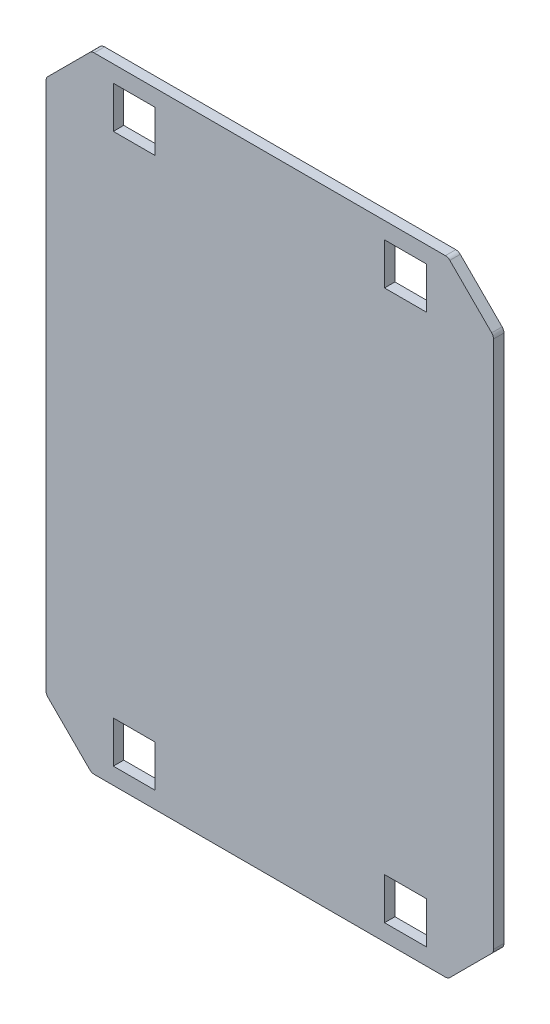
ISO-10303-21;
HEADER;
FILE_DESCRIPTION(('STEP AP214'),'2;1');
FILE_NAME('part.step','',(''),(''),'','','');
FILE_SCHEMA(('AUTOMOTIVE_DESIGN { 1 0 10303 214 1 1 1 1 }'));
ENDSEC;
DATA;
#1=APPLICATION_CONTEXT('core data for automotive mechanical design processes');
#2=APPLICATION_PROTOCOL_DEFINITION('international standard','automotive_design',2000,#1);
#3=PRODUCT_CONTEXT('',#1,'mechanical');
#4=PRODUCT('Part','Part','',(#3));
#5=PRODUCT_RELATED_PRODUCT_CATEGORY('part','',(#4));
#6=PRODUCT_DEFINITION_FORMATION('','',#4);
#7=PRODUCT_DEFINITION_CONTEXT('part definition',#1,'design');
#8=PRODUCT_DEFINITION('design','',#6,#7);
#9=PRODUCT_DEFINITION_SHAPE('','',#8);
#10=(LENGTH_UNIT() NAMED_UNIT(*) SI_UNIT(.MILLI.,.METRE.));
#11=(NAMED_UNIT(*) PLANE_ANGLE_UNIT() SI_UNIT($,.RADIAN.));
#12=(NAMED_UNIT(*) SI_UNIT($,.STERADIAN.) SOLID_ANGLE_UNIT());
#13=UNCERTAINTY_MEASURE_WITH_UNIT(LENGTH_MEASURE(1.E-05),#10,'distance_accuracy_value','');
#14=(GEOMETRIC_REPRESENTATION_CONTEXT(3) GLOBAL_UNCERTAINTY_ASSIGNED_CONTEXT((#13)) GLOBAL_UNIT_ASSIGNED_CONTEXT((#10,
#11,#12)) REPRESENTATION_CONTEXT('',''));
#15=CARTESIAN_POINT('',(0.,0.,0.));
#16=DIRECTION('',(0.,0.,1.));
#17=DIRECTION('',(1.,0.,0.));
#18=AXIS2_PLACEMENT_3D('',#15,#16,#17);
#19=CARTESIAN_POINT('',(0.,0.,5.));
#20=DIRECTION('',(0.,0.,-1.));
#21=DIRECTION('',(-1.,0.,0.));
#22=AXIS2_PLACEMENT_3D('',#19,#20,#21);
#23=PLANE('',#22);
#24=DIRECTION('',(-1.,0.,0.));
#25=VECTOR('',#24,1.);
#26=CARTESIAN_POINT('',(-75.,141.748737341529,5.));
#27=LINE('',#26,#25);
#28=CARTESIAN_POINT('',(-55.,141.748737341529,5.));
#29=VERTEX_POINT('',#28);
#30=CARTESIAN_POINT('',(-75.,141.748737341529,5.));
#31=VERTEX_POINT('',#30);
#32=EDGE_CURVE('E372',#29,#31,#27,.T.);
#33=ORIENTED_EDGE('',*,*,#32,.F.);
#34=DIRECTION('',(0.,1.,0.));
#35=VECTOR('',#34,1.);
#36=CARTESIAN_POINT('',(-55.,141.748737341529,5.));
#37=LINE('',#36,#35);
#38=CARTESIAN_POINT('',(-55.,121.748737341529,5.));
#39=VERTEX_POINT('',#38);
#40=EDGE_CURVE('E289',#39,#29,#37,.T.);
#41=ORIENTED_EDGE('',*,*,#40,.F.);
#42=DIRECTION('',(1.,0.,0.));
#43=VECTOR('',#42,1.);
#44=CARTESIAN_POINT('',(-75.,121.748737341529,5.));
#45=LINE('',#44,#43);
#46=CARTESIAN_POINT('',(-75.,121.748737341529,5.));
#47=VERTEX_POINT('',#46);
#48=EDGE_CURVE('E361',#47,#39,#45,.T.);
#49=ORIENTED_EDGE('',*,*,#48,.F.);
#50=DIRECTION('',(0.,-1.,0.));
#51=VECTOR('',#50,1.);
#52=CARTESIAN_POINT('',(-75.,141.748737341529,5.));
#53=LINE('',#52,#51);
#54=EDGE_CURVE('E375',#31,#47,#53,.T.);
#55=ORIENTED_EDGE('',*,*,#54,.F.);
#56=EDGE_LOOP('',(#33,#41,#49,#55));
#57=FACE_BOUND('',#56,.T.);
#58=DIRECTION('',(1.,0.,0.));
#59=VECTOR('',#58,1.);
#60=CARTESIAN_POINT('',(-74.9999999999999,-141.748737341529,5.));
#61=LINE('',#60,#59);
#62=CARTESIAN_POINT('',(-74.9999999999999,-141.748737341529,5.));
#63=VERTEX_POINT('',#62);
#64=CARTESIAN_POINT('',(-54.9999999999999,-141.748737341529,5.));
#65=VERTEX_POINT('',#64);
#66=EDGE_CURVE('E282',#63,#65,#61,.T.);
#67=ORIENTED_EDGE('',*,*,#66,.F.);
#68=DIRECTION('',(0.,-1.,0.));
#69=VECTOR('',#68,1.);
#70=CARTESIAN_POINT('',(-74.9999999999999,-141.748737341529,5.));
#71=LINE('',#70,#69);
#72=CARTESIAN_POINT('',(-75.,-121.748737341529,5.));
#73=VERTEX_POINT('',#72);
#74=EDGE_CURVE('E252',#73,#63,#71,.T.);
#75=ORIENTED_EDGE('',*,*,#74,.F.);
#76=DIRECTION('',(-1.,0.,0.));
#77=VECTOR('',#76,1.);
#78=CARTESIAN_POINT('',(-75.,-121.748737341529,5.));
#79=LINE('',#78,#77);
#80=CARTESIAN_POINT('',(-55.,-121.748737341529,5.));
#81=VERTEX_POINT('',#80);
#82=EDGE_CURVE('E270',#81,#73,#79,.T.);
#83=ORIENTED_EDGE('',*,*,#82,.F.);
#84=DIRECTION('',(0.,1.,0.));
#85=VECTOR('',#84,1.);
#86=CARTESIAN_POINT('',(-54.9999999999999,-141.748737341529,5.));
#87=LINE('',#86,#85);
#88=EDGE_CURVE('E273',#65,#81,#87,.T.);
#89=ORIENTED_EDGE('',*,*,#88,.F.);
#90=EDGE_LOOP('',(#67,#75,#83,#89));
#91=FACE_BOUND('',#90,.T.);
#92=DIRECTION('',(-1.,0.,0.));
#93=VECTOR('',#92,1.);
#94=CARTESIAN_POINT('',(75.,-121.748737341529,5.));
#95=LINE('',#94,#93);
#96=CARTESIAN_POINT('',(75.,-121.748737341529,5.));
#97=VERTEX_POINT('',#96);
#98=CARTESIAN_POINT('',(55.,-121.748737341529,5.));
#99=VERTEX_POINT('',#98);
#100=EDGE_CURVE('E309',#97,#99,#95,.T.);
#101=ORIENTED_EDGE('',*,*,#100,.F.);
#102=DIRECTION('',(0.,1.,0.));
#103=VECTOR('',#102,1.);
#104=CARTESIAN_POINT('',(75.,-141.748737341529,5.));
#105=LINE('',#104,#103);
#106=CARTESIAN_POINT('',(75.,-141.748737341529,5.));
#107=VERTEX_POINT('',#106);
#108=EDGE_CURVE('E307',#107,#97,#105,.T.);
#109=ORIENTED_EDGE('',*,*,#108,.F.);
#110=DIRECTION('',(1.,0.,0.));
#111=VECTOR('',#110,1.);
#112=CARTESIAN_POINT('',(75.,-141.748737341529,5.));
#113=LINE('',#112,#111);
#114=CARTESIAN_POINT('',(55.,-141.748737341529,5.));
#115=VERTEX_POINT('',#114);
#116=EDGE_CURVE('E297',#115,#107,#113,.T.);
#117=ORIENTED_EDGE('',*,*,#116,.F.);
#118=DIRECTION('',(0.,-1.,0.));
#119=VECTOR('',#118,1.);
#120=CARTESIAN_POINT('',(55.,-141.748737341529,5.));
#121=LINE('',#120,#119);
#122=EDGE_CURVE('E313',#99,#115,#121,.T.);
#123=ORIENTED_EDGE('',*,*,#122,.F.);
#124=EDGE_LOOP('',(#101,#109,#117,#123));
#125=FACE_BOUND('',#124,.T.);
#126=DIRECTION('',(-1.,0.,0.));
#127=VECTOR('',#126,1.);
#128=CARTESIAN_POINT('',(75.0000000000001,141.748737341529,5.));
#129=LINE('',#128,#127);
#130=CARTESIAN_POINT('',(75.0000000000001,141.748737341529,5.));
#131=VERTEX_POINT('',#130);
#132=CARTESIAN_POINT('',(55.0000000000001,141.748737341529,5.));
#133=VERTEX_POINT('',#132);
#134=EDGE_CURVE('E341',#131,#133,#129,.T.);
#135=ORIENTED_EDGE('',*,*,#134,.F.);
#136=DIRECTION('',(0.,1.,0.));
#137=VECTOR('',#136,1.);
#138=CARTESIAN_POINT('',(75.0000000000001,141.748737341529,5.));
#139=LINE('',#138,#137);
#140=CARTESIAN_POINT('',(75.0000000000001,121.748737341529,5.));
#141=VERTEX_POINT('',#140);
#142=EDGE_CURVE('E339',#141,#131,#139,.T.);
#143=ORIENTED_EDGE('',*,*,#142,.F.);
#144=DIRECTION('',(1.,0.,0.));
#145=VECTOR('',#144,1.);
#146=CARTESIAN_POINT('',(75.0000000000001,121.748737341529,5.));
#147=LINE('',#146,#145);
#148=CARTESIAN_POINT('',(55.0000000000001,121.748737341529,5.));
#149=VERTEX_POINT('',#148);
#150=EDGE_CURVE('E329',#149,#141,#147,.T.);
#151=ORIENTED_EDGE('',*,*,#150,.F.);
#152=DIRECTION('',(0.,-1.,0.));
#153=VECTOR('',#152,1.);
#154=CARTESIAN_POINT('',(55.0000000000001,141.748737341529,5.));
#155=LINE('',#154,#153);
#156=EDGE_CURVE('E345',#133,#149,#155,.T.);
#157=ORIENTED_EDGE('',*,*,#156,.F.);
#158=EDGE_LOOP('',(#135,#143,#151,#157));
#159=FACE_BOUND('',#158,.T.);
#160=DIRECTION('',(0.,-1.,0.));
#161=VECTOR('',#160,1.);
#162=CARTESIAN_POINT('',(-107.248737341529,127.928932188135,5.));
#163=LINE('',#162,#161);
#164=CARTESIAN_POINT('',(-107.248737341529,126.686291501015,5.));
#165=VERTEX_POINT('',#164);
#166=CARTESIAN_POINT('',(-107.248737341529,-126.686291501015,5.));
#167=VERTEX_POINT('',#166);
#168=EDGE_CURVE('E495',#165,#167,#163,.T.);
#169=ORIENTED_EDGE('',*,*,#168,.T.);
#170=CARTESIAN_POINT('',(-104.248737341529,-126.686291501015,5.));
#171=DIRECTION('',(0.,0.,-1.));
#172=DIRECTION('',(-1.,0.,0.));
#173=AXIS2_PLACEMENT_3D('',#170,#171,#172);
#174=CIRCLE('',#173,3.);
#175=CARTESIAN_POINT('',(-106.370057685089,-128.807611844575,5.));
#176=VERTEX_POINT('',#175);
#177=EDGE_CURVE('E407',#167,#176,#174,.F.);
#178=ORIENTED_EDGE('',*,*,#177,.T.);
#179=DIRECTION('',(0.707106781186548,-0.707106781186548,0.));
#180=VECTOR('',#179,1.);
#181=CARTESIAN_POINT('',(-107.248737341529,-127.928932188134,5.));
#182=LINE('',#181,#180);
#183=CARTESIAN_POINT('',(-86.3076118445748,-148.870057685089,5.));
#184=VERTEX_POINT('',#183);
#185=EDGE_CURVE('E492',#176,#184,#182,.T.);
#186=ORIENTED_EDGE('',*,*,#185,.T.);
#187=CARTESIAN_POINT('',(-84.1862915010151,-146.748737341529,5.));
#188=DIRECTION('',(0.,0.,-1.));
#189=DIRECTION('',(-1.,0.,0.));
#190=AXIS2_PLACEMENT_3D('',#187,#188,#189);
#191=CIRCLE('',#190,3.);
#192=CARTESIAN_POINT('',(-84.1862915010151,-149.748737341529,5.));
#193=VERTEX_POINT('',#192);
#194=EDGE_CURVE('E405',#184,#193,#191,.F.);
#195=ORIENTED_EDGE('',*,*,#194,.T.);
#196=DIRECTION('',(1.,0.,0.));
#197=VECTOR('',#196,1.);
#198=CARTESIAN_POINT('',(-85.4289321881344,-149.748737341529,5.));
#199=LINE('',#198,#197);
#200=CARTESIAN_POINT('',(84.1862915010154,-149.748737341529,5.));
#201=VERTEX_POINT('',#200);
#202=EDGE_CURVE('E489',#193,#201,#199,.T.);
#203=ORIENTED_EDGE('',*,*,#202,.T.);
#204=CARTESIAN_POINT('',(84.1862915010154,-146.748737341529,5.));
#205=DIRECTION('',(0.,0.,-1.));
#206=DIRECTION('',(-1.,0.,0.));
#207=AXIS2_PLACEMENT_3D('',#204,#205,#206);
#208=CIRCLE('',#207,3.);
#209=CARTESIAN_POINT('',(86.307611844575,-148.870057685089,5.));
#210=VERTEX_POINT('',#209);
#211=EDGE_CURVE('E403',#201,#210,#208,.F.);
#212=ORIENTED_EDGE('',*,*,#211,.T.);
#213=DIRECTION('',(0.707106781186547,0.707106781186548,0.));
#214=VECTOR('',#213,1.);
#215=CARTESIAN_POINT('',(107.248737341529,-127.928932188135,5.));
#216=LINE('',#215,#214);
#217=CARTESIAN_POINT('',(106.370057685089,-128.807611844575,5.));
#218=VERTEX_POINT('',#217);
#219=EDGE_CURVE('E484',#210,#218,#216,.T.);
#220=ORIENTED_EDGE('',*,*,#219,.T.);
#221=CARTESIAN_POINT('',(104.248737341529,-126.686291501015,5.));
#222=DIRECTION('',(0.,0.,-1.));
#223=DIRECTION('',(-1.,0.,0.));
#224=AXIS2_PLACEMENT_3D('',#221,#222,#223);
#225=CIRCLE('',#224,3.);
#226=CARTESIAN_POINT('',(107.248737341529,-126.686291501015,5.));
#227=VERTEX_POINT('',#226);
#228=EDGE_CURVE('E401',#218,#227,#225,.F.);
#229=ORIENTED_EDGE('',*,*,#228,.T.);
#230=DIRECTION('',(0.,1.,0.));
#231=VECTOR('',#230,1.);
#232=CARTESIAN_POINT('',(107.248737341529,127.928932188135,5.));
#233=LINE('',#232,#231);
#234=CARTESIAN_POINT('',(107.248737341529,126.686291501015,5.));
#235=VERTEX_POINT('',#234);
#236=EDGE_CURVE('E481',#227,#235,#233,.T.);
#237=ORIENTED_EDGE('',*,*,#236,.T.);
#238=CARTESIAN_POINT('',(104.248737341529,126.686291501015,5.));
#239=DIRECTION('',(0.,0.,-1.));
#240=DIRECTION('',(-1.,0.,0.));
#241=AXIS2_PLACEMENT_3D('',#238,#239,#240);
#242=CIRCLE('',#241,3.);
#243=CARTESIAN_POINT('',(106.370057685089,128.807611844575,5.));
#244=VERTEX_POINT('',#243);
#245=EDGE_CURVE('E399',#235,#244,#242,.F.);
#246=ORIENTED_EDGE('',*,*,#245,.T.);
#247=DIRECTION('',(-0.707106781186548,0.707106781186547,0.));
#248=VECTOR('',#247,1.);
#249=CARTESIAN_POINT('',(85.4289321881344,149.748737341529,5.));
#250=LINE('',#249,#248);
#251=CARTESIAN_POINT('',(86.3076118445748,148.870057685089,5.));
#252=VERTEX_POINT('',#251);
#253=EDGE_CURVE('E480',#244,#252,#250,.T.);
#254=ORIENTED_EDGE('',*,*,#253,.T.);
#255=CARTESIAN_POINT('',(84.1862915010152,146.748737341529,5.));
#256=DIRECTION('',(0.,0.,-1.));
#257=DIRECTION('',(-1.,0.,0.));
#258=AXIS2_PLACEMENT_3D('',#255,#256,#257);
#259=CIRCLE('',#258,3.);
#260=CARTESIAN_POINT('',(84.1862915010152,149.748737341529,5.));
#261=VERTEX_POINT('',#260);
#262=EDGE_CURVE('E397',#252,#261,#259,.F.);
#263=ORIENTED_EDGE('',*,*,#262,.T.);
#264=DIRECTION('',(-1.,0.,0.));
#265=VECTOR('',#264,1.);
#266=CARTESIAN_POINT('',(-85.4289321881345,149.748737341529,5.));
#267=LINE('',#266,#265);
#268=CARTESIAN_POINT('',(-84.1862915010152,149.748737341529,5.));
#269=VERTEX_POINT('',#268);
#270=EDGE_CURVE('E276',#261,#269,#267,.T.);
#271=ORIENTED_EDGE('',*,*,#270,.T.);
#272=CARTESIAN_POINT('',(-84.1862915010152,146.748737341529,5.));
#273=DIRECTION('',(0.,0.,-1.));
#274=DIRECTION('',(-1.,0.,0.));
#275=AXIS2_PLACEMENT_3D('',#272,#273,#274);
#276=CIRCLE('',#275,3.);
#277=CARTESIAN_POINT('',(-86.3076118445749,148.870057685089,5.));
#278=VERTEX_POINT('',#277);
#279=EDGE_CURVE('E393',#269,#278,#276,.F.);
#280=ORIENTED_EDGE('',*,*,#279,.T.);
#281=DIRECTION('',(-0.707106781186547,-0.707106781186548,0.));
#282=VECTOR('',#281,1.);
#283=CARTESIAN_POINT('',(-85.4289321881345,149.748737341529,5.));
#284=LINE('',#283,#282);
#285=CARTESIAN_POINT('',(-106.370057685089,128.807611844575,5.));
#286=VERTEX_POINT('',#285);
#287=EDGE_CURVE('E461',#278,#286,#284,.T.);
#288=ORIENTED_EDGE('',*,*,#287,.T.);
#289=CARTESIAN_POINT('',(-104.248737341529,126.686291501015,5.));
#290=DIRECTION('',(0.,0.,-1.));
#291=DIRECTION('',(-1.,0.,0.));
#292=AXIS2_PLACEMENT_3D('',#289,#290,#291);
#293=CIRCLE('',#292,3.);
#294=EDGE_CURVE('E395',#286,#165,#293,.F.);
#295=ORIENTED_EDGE('',*,*,#294,.T.);
#296=EDGE_LOOP('',(#169,#178,#186,#195,#203,#212,#220,#229,#237,#246,#254,#263,#271,#280,#288,#295));
#297=FACE_BOUND('',#296,.T.);
#298=ADVANCED_FACE('F34',(#57,#91,#125,#159,#297),#23,.F.);
#299=CARTESIAN_POINT('',(0.,0.,0.));
#300=DIRECTION('',(0.,0.,-1.));
#301=DIRECTION('',(-1.,0.,0.));
#302=AXIS2_PLACEMENT_3D('',#299,#300,#301);
#303=PLANE('',#302);
#304=DIRECTION('',(0.,1.,0.));
#305=VECTOR('',#304,1.);
#306=CARTESIAN_POINT('',(-55.,141.748737341529,0.));
#307=LINE('',#306,#305);
#308=CARTESIAN_POINT('',(-55.,121.748737341529,0.));
#309=VERTEX_POINT('',#308);
#310=CARTESIAN_POINT('',(-55.,141.748737341529,0.));
#311=VERTEX_POINT('',#310);
#312=EDGE_CURVE('E357',#309,#311,#307,.T.);
#313=ORIENTED_EDGE('',*,*,#312,.T.);
#314=DIRECTION('',(-1.,0.,0.));
#315=VECTOR('',#314,1.);
#316=CARTESIAN_POINT('',(-75.,141.748737341529,0.));
#317=LINE('',#316,#315);
#318=CARTESIAN_POINT('',(-75.,141.748737341529,0.));
#319=VERTEX_POINT('',#318);
#320=EDGE_CURVE('E360',#311,#319,#317,.T.);
#321=ORIENTED_EDGE('',*,*,#320,.T.);
#322=DIRECTION('',(0.,-1.,0.));
#323=VECTOR('',#322,1.);
#324=CARTESIAN_POINT('',(-75.,141.748737341529,0.));
#325=LINE('',#324,#323);
#326=CARTESIAN_POINT('',(-75.,121.748737341529,0.));
#327=VERTEX_POINT('',#326);
#328=EDGE_CURVE('E364',#319,#327,#325,.T.);
#329=ORIENTED_EDGE('',*,*,#328,.T.);
#330=DIRECTION('',(1.,0.,0.));
#331=VECTOR('',#330,1.);
#332=CARTESIAN_POINT('',(-75.,121.748737341529,0.));
#333=LINE('',#332,#331);
#334=EDGE_CURVE('E367',#327,#309,#333,.T.);
#335=ORIENTED_EDGE('',*,*,#334,.T.);
#336=EDGE_LOOP('',(#313,#321,#329,#335));
#337=FACE_BOUND('',#336,.T.);
#338=DIRECTION('',(0.,-1.,0.));
#339=VECTOR('',#338,1.);
#340=CARTESIAN_POINT('',(-74.9999999999999,-141.748737341529,0.));
#341=LINE('',#340,#339);
#342=CARTESIAN_POINT('',(-75.,-121.748737341529,0.));
#343=VERTEX_POINT('',#342);
#344=CARTESIAN_POINT('',(-74.9999999999999,-141.748737341529,0.));
#345=VERTEX_POINT('',#344);
#346=EDGE_CURVE('E249',#343,#345,#341,.T.);
#347=ORIENTED_EDGE('',*,*,#346,.T.);
#348=DIRECTION('',(1.,0.,0.));
#349=VECTOR('',#348,1.);
#350=CARTESIAN_POINT('',(-74.9999999999999,-141.748737341529,0.));
#351=LINE('',#350,#349);
#352=CARTESIAN_POINT('',(-54.9999999999999,-141.748737341529,0.));
#353=VERTEX_POINT('',#352);
#354=EDGE_CURVE('E261',#345,#353,#351,.T.);
#355=ORIENTED_EDGE('',*,*,#354,.T.);
#356=DIRECTION('',(0.,1.,0.));
#357=VECTOR('',#356,1.);
#358=CARTESIAN_POINT('',(-54.9999999999999,-141.748737341529,0.));
#359=LINE('',#358,#357);
#360=CARTESIAN_POINT('',(-55.,-121.748737341529,0.));
#361=VERTEX_POINT('',#360);
#362=EDGE_CURVE('E265',#353,#361,#359,.T.);
#363=ORIENTED_EDGE('',*,*,#362,.T.);
#364=DIRECTION('',(-1.,0.,0.));
#365=VECTOR('',#364,1.);
#366=CARTESIAN_POINT('',(-75.,-121.748737341529,0.));
#367=LINE('',#366,#365);
#368=EDGE_CURVE('E257',#361,#343,#367,.T.);
#369=ORIENTED_EDGE('',*,*,#368,.T.);
#370=EDGE_LOOP('',(#347,#355,#363,#369));
#371=FACE_BOUND('',#370,.T.);
#372=DIRECTION('',(0.,1.,0.));
#373=VECTOR('',#372,1.);
#374=CARTESIAN_POINT('',(75.,-141.748737341529,0.));
#375=LINE('',#374,#373);
#376=CARTESIAN_POINT('',(75.,-141.748737341529,0.));
#377=VERTEX_POINT('',#376);
#378=CARTESIAN_POINT('',(75.,-121.748737341529,0.));
#379=VERTEX_POINT('',#378);
#380=EDGE_CURVE('E293',#377,#379,#375,.T.);
#381=ORIENTED_EDGE('',*,*,#380,.T.);
#382=DIRECTION('',(-1.,0.,0.));
#383=VECTOR('',#382,1.);
#384=CARTESIAN_POINT('',(75.,-121.748737341529,0.));
#385=LINE('',#384,#383);
#386=CARTESIAN_POINT('',(55.,-121.748737341529,0.));
#387=VERTEX_POINT('',#386);
#388=EDGE_CURVE('E296',#379,#387,#385,.T.);
#389=ORIENTED_EDGE('',*,*,#388,.T.);
#390=DIRECTION('',(0.,-1.,0.));
#391=VECTOR('',#390,1.);
#392=CARTESIAN_POINT('',(55.,-141.748737341529,0.));
#393=LINE('',#392,#391);
#394=CARTESIAN_POINT('',(55.,-141.748737341529,0.));
#395=VERTEX_POINT('',#394);
#396=EDGE_CURVE('E300',#387,#395,#393,.T.);
#397=ORIENTED_EDGE('',*,*,#396,.T.);
#398=DIRECTION('',(1.,0.,0.));
#399=VECTOR('',#398,1.);
#400=CARTESIAN_POINT('',(75.,-141.748737341529,0.));
#401=LINE('',#400,#399);
#402=EDGE_CURVE('E303',#395,#377,#401,.T.);
#403=ORIENTED_EDGE('',*,*,#402,.T.);
#404=EDGE_LOOP('',(#381,#389,#397,#403));
#405=FACE_BOUND('',#404,.T.);
#406=DIRECTION('',(0.,1.,0.));
#407=VECTOR('',#406,1.);
#408=CARTESIAN_POINT('',(75.0000000000001,141.748737341529,0.));
#409=LINE('',#408,#407);
#410=CARTESIAN_POINT('',(75.0000000000001,121.748737341529,0.));
#411=VERTEX_POINT('',#410);
#412=CARTESIAN_POINT('',(75.0000000000001,141.748737341529,0.));
#413=VERTEX_POINT('',#412);
#414=EDGE_CURVE('E325',#411,#413,#409,.T.);
#415=ORIENTED_EDGE('',*,*,#414,.T.);
#416=DIRECTION('',(-1.,0.,0.));
#417=VECTOR('',#416,1.);
#418=CARTESIAN_POINT('',(75.0000000000001,141.748737341529,0.));
#419=LINE('',#418,#417);
#420=CARTESIAN_POINT('',(55.0000000000001,141.748737341529,0.));
#421=VERTEX_POINT('',#420);
#422=EDGE_CURVE('E328',#413,#421,#419,.T.);
#423=ORIENTED_EDGE('',*,*,#422,.T.);
#424=DIRECTION('',(0.,-1.,0.));
#425=VECTOR('',#424,1.);
#426=CARTESIAN_POINT('',(55.0000000000001,141.748737341529,0.));
#427=LINE('',#426,#425);
#428=CARTESIAN_POINT('',(55.0000000000001,121.748737341529,0.));
#429=VERTEX_POINT('',#428);
#430=EDGE_CURVE('E332',#421,#429,#427,.T.);
#431=ORIENTED_EDGE('',*,*,#430,.T.);
#432=DIRECTION('',(1.,0.,0.));
#433=VECTOR('',#432,1.);
#434=CARTESIAN_POINT('',(75.0000000000001,121.748737341529,0.));
#435=LINE('',#434,#433);
#436=EDGE_CURVE('E335',#429,#411,#435,.T.);
#437=ORIENTED_EDGE('',*,*,#436,.T.);
#438=EDGE_LOOP('',(#415,#423,#431,#437));
#439=FACE_BOUND('',#438,.T.);
#440=DIRECTION('',(0.707106781186548,-0.707106781186548,0.));
#441=VECTOR('',#440,1.);
#442=CARTESIAN_POINT('',(-107.248737341529,-127.928932188134,0.));
#443=LINE('',#442,#441);
#444=CARTESIAN_POINT('',(-106.370057685089,-128.807611844575,0.));
#445=VERTEX_POINT('',#444);
#446=CARTESIAN_POINT('',(-86.3076118445748,-148.870057685089,0.));
#447=VERTEX_POINT('',#446);
#448=EDGE_CURVE('E510',#445,#447,#443,.T.);
#449=ORIENTED_EDGE('',*,*,#448,.F.);
#450=CARTESIAN_POINT('',(-104.248737341529,-126.686291501015,0.));
#451=DIRECTION('',(0.,0.,-1.));
#452=DIRECTION('',(-1.,0.,0.));
#453=AXIS2_PLACEMENT_3D('',#450,#451,#452);
#454=CIRCLE('',#453,3.);
#455=CARTESIAN_POINT('',(-107.248737341529,-126.686291501015,0.));
#456=VERTEX_POINT('',#455);
#457=EDGE_CURVE('E427',#445,#456,#454,.T.);
#458=ORIENTED_EDGE('',*,*,#457,.T.);
#459=DIRECTION('',(0.,-1.,0.));
#460=VECTOR('',#459,1.);
#461=CARTESIAN_POINT('',(-107.248737341529,127.928932188135,0.));
#462=LINE('',#461,#460);
#463=CARTESIAN_POINT('',(-107.248737341529,126.686291501015,0.));
#464=VERTEX_POINT('',#463);
#465=EDGE_CURVE('E469',#464,#456,#462,.T.);
#466=ORIENTED_EDGE('',*,*,#465,.F.);
#467=CARTESIAN_POINT('',(-104.248737341529,126.686291501015,0.));
#468=DIRECTION('',(0.,0.,-1.));
#469=DIRECTION('',(-1.,0.,0.));
#470=AXIS2_PLACEMENT_3D('',#467,#468,#469);
#471=CIRCLE('',#470,3.);
#472=CARTESIAN_POINT('',(-106.370057685089,128.807611844575,0.));
#473=VERTEX_POINT('',#472);
#474=EDGE_CURVE('E416',#464,#473,#471,.T.);
#475=ORIENTED_EDGE('',*,*,#474,.T.);
#476=DIRECTION('',(-0.707106781186547,-0.707106781186548,0.));
#477=VECTOR('',#476,1.);
#478=CARTESIAN_POINT('',(-85.4289321881345,149.748737341529,0.));
#479=LINE('',#478,#477);
#480=CARTESIAN_POINT('',(-86.3076118445749,148.870057685089,0.));
#481=VERTEX_POINT('',#480);
#482=EDGE_CURVE('E458',#481,#473,#479,.T.);
#483=ORIENTED_EDGE('',*,*,#482,.F.);
#484=CARTESIAN_POINT('',(-84.1862915010152,146.748737341529,0.));
#485=DIRECTION('',(0.,0.,-1.));
#486=DIRECTION('',(-1.,0.,0.));
#487=AXIS2_PLACEMENT_3D('',#484,#485,#486);
#488=CIRCLE('',#487,3.);
#489=CARTESIAN_POINT('',(-84.1862915010152,149.748737341529,0.));
#490=VERTEX_POINT('',#489);
#491=EDGE_CURVE('E414',#481,#490,#488,.T.);
#492=ORIENTED_EDGE('',*,*,#491,.T.);
#493=DIRECTION('',(-1.,0.,0.));
#494=VECTOR('',#493,1.);
#495=CARTESIAN_POINT('',(-85.4289321881345,149.748737341529,0.));
#496=LINE('',#495,#494);
#497=CARTESIAN_POINT('',(84.1862915010152,149.748737341529,0.));
#498=VERTEX_POINT('',#497);
#499=EDGE_CURVE('E342',#498,#490,#496,.T.);
#500=ORIENTED_EDGE('',*,*,#499,.F.);
#501=CARTESIAN_POINT('',(84.1862915010152,146.748737341529,0.));
#502=DIRECTION('',(0.,0.,-1.));
#503=DIRECTION('',(-1.,0.,0.));
#504=AXIS2_PLACEMENT_3D('',#501,#502,#503);
#505=CIRCLE('',#504,3.);
#506=CARTESIAN_POINT('',(86.3076118445748,148.870057685089,0.));
#507=VERTEX_POINT('',#506);
#508=EDGE_CURVE('E418',#498,#507,#505,.T.);
#509=ORIENTED_EDGE('',*,*,#508,.T.);
#510=DIRECTION('',(-0.707106781186548,0.707106781186547,0.));
#511=VECTOR('',#510,1.);
#512=CARTESIAN_POINT('',(85.4289321881344,149.748737341529,0.));
#513=LINE('',#512,#511);
#514=CARTESIAN_POINT('',(106.370057685089,128.807611844575,0.));
#515=VERTEX_POINT('',#514);
#516=EDGE_CURVE('E499',#515,#507,#513,.T.);
#517=ORIENTED_EDGE('',*,*,#516,.F.);
#518=CARTESIAN_POINT('',(104.248737341529,126.686291501015,0.));
#519=DIRECTION('',(0.,0.,-1.));
#520=DIRECTION('',(-1.,0.,0.));
#521=AXIS2_PLACEMENT_3D('',#518,#519,#520);
#522=CIRCLE('',#521,3.);
#523=CARTESIAN_POINT('',(107.248737341529,126.686291501015,0.));
#524=VERTEX_POINT('',#523);
#525=EDGE_CURVE('E420',#515,#524,#522,.T.);
#526=ORIENTED_EDGE('',*,*,#525,.T.);
#527=DIRECTION('',(0.,1.,0.));
#528=VECTOR('',#527,1.);
#529=CARTESIAN_POINT('',(107.248737341529,127.928932188135,0.));
#530=LINE('',#529,#528);
#531=CARTESIAN_POINT('',(107.248737341529,-126.686291501015,0.));
#532=VERTEX_POINT('',#531);
#533=EDGE_CURVE('E502',#532,#524,#530,.T.);
#534=ORIENTED_EDGE('',*,*,#533,.F.);
#535=CARTESIAN_POINT('',(104.248737341529,-126.686291501015,0.));
#536=DIRECTION('',(0.,0.,-1.));
#537=DIRECTION('',(-1.,0.,0.));
#538=AXIS2_PLACEMENT_3D('',#535,#536,#537);
#539=CIRCLE('',#538,3.);
#540=CARTESIAN_POINT('',(106.370057685089,-128.807611844575,0.));
#541=VERTEX_POINT('',#540);
#542=EDGE_CURVE('E422',#532,#541,#539,.T.);
#543=ORIENTED_EDGE('',*,*,#542,.T.);
#544=DIRECTION('',(0.707106781186547,0.707106781186548,0.));
#545=VECTOR('',#544,1.);
#546=CARTESIAN_POINT('',(107.248737341529,-127.928932188135,0.));
#547=LINE('',#546,#545);
#548=CARTESIAN_POINT('',(86.307611844575,-148.870057685089,0.));
#549=VERTEX_POINT('',#548);
#550=EDGE_CURVE('E505',#549,#541,#547,.T.);
#551=ORIENTED_EDGE('',*,*,#550,.F.);
#552=CARTESIAN_POINT('',(84.1862915010154,-146.748737341529,0.));
#553=DIRECTION('',(0.,0.,-1.));
#554=DIRECTION('',(-1.,0.,0.));
#555=AXIS2_PLACEMENT_3D('',#552,#553,#554);
#556=CIRCLE('',#555,3.);
#557=CARTESIAN_POINT('',(84.1862915010154,-149.748737341529,0.));
#558=VERTEX_POINT('',#557);
#559=EDGE_CURVE('E49',#549,#558,#556,.T.);
#560=ORIENTED_EDGE('',*,*,#559,.T.);
#561=DIRECTION('',(1.,0.,0.));
#562=VECTOR('',#561,1.);
#563=CARTESIAN_POINT('',(-85.4289321881344,-149.748737341529,0.));
#564=LINE('',#563,#562);
#565=CARTESIAN_POINT('',(-84.1862915010151,-149.748737341529,0.));
#566=VERTEX_POINT('',#565);
#567=EDGE_CURVE('E508',#566,#558,#564,.T.);
#568=ORIENTED_EDGE('',*,*,#567,.F.);
#569=CARTESIAN_POINT('',(-84.1862915010151,-146.748737341529,0.));
#570=DIRECTION('',(0.,0.,-1.));
#571=DIRECTION('',(-1.,0.,0.));
#572=AXIS2_PLACEMENT_3D('',#569,#570,#571);
#573=CIRCLE('',#572,3.);
#574=EDGE_CURVE('E425',#566,#447,#573,.T.);
#575=ORIENTED_EDGE('',*,*,#574,.T.);
#576=EDGE_LOOP('',(#449,#458,#466,#475,#483,#492,#500,#509,#517,#526,#534,#543,#551,#560,#568,#575));
#577=FACE_BOUND('',#576,.T.);
#578=ADVANCED_FACE('F267',(#337,#371,#405,#439,#577),#303,.T.);
#579=CARTESIAN_POINT('',(-55.,141.748737341529,0.));
#580=DIRECTION('',(1.,0.,0.));
#581=DIRECTION('',(0.,0.,-1.));
#582=AXIS2_PLACEMENT_3D('',#579,#580,#581);
#583=PLANE('',#582);
#584=ORIENTED_EDGE('',*,*,#40,.T.);
#585=DIRECTION('',(0.,0.,1.));
#586=VECTOR('',#585,1.);
#587=CARTESIAN_POINT('',(-55.,141.748737341529,0.));
#588=LINE('',#587,#586);
#589=EDGE_CURVE('E370',#311,#29,#588,.T.);
#590=ORIENTED_EDGE('',*,*,#589,.F.);
#591=ORIENTED_EDGE('',*,*,#312,.F.);
#592=DIRECTION('',(0.,0.,1.));
#593=VECTOR('',#592,1.);
#594=CARTESIAN_POINT('',(-55.,121.748737341529,0.));
#595=LINE('',#594,#593);
#596=EDGE_CURVE('E380',#309,#39,#595,.T.);
#597=ORIENTED_EDGE('',*,*,#596,.T.);
#598=EDGE_LOOP('',(#584,#590,#591,#597));
#599=FACE_BOUND('',#598,.T.);
#600=ADVANCED_FACE('F575',(#599),#583,.F.);
#601=CARTESIAN_POINT('',(-75.,121.748737341529,0.));
#602=DIRECTION('',(0.,-1.,0.));
#603=DIRECTION('',(0.,0.,-1.));
#604=AXIS2_PLACEMENT_3D('',#601,#602,#603);
#605=PLANE('',#604);
#606=ORIENTED_EDGE('',*,*,#48,.T.);
#607=ORIENTED_EDGE('',*,*,#596,.F.);
#608=ORIENTED_EDGE('',*,*,#334,.F.);
#609=DIRECTION('',(0.,0.,1.));
#610=VECTOR('',#609,1.);
#611=CARTESIAN_POINT('',(-75.,121.748737341529,0.));
#612=LINE('',#611,#610);
#613=EDGE_CURVE('E383',#327,#47,#612,.T.);
#614=ORIENTED_EDGE('',*,*,#613,.T.);
#615=EDGE_LOOP('',(#606,#607,#608,#614));
#616=FACE_BOUND('',#615,.T.);
#617=ADVANCED_FACE('F819',(#616),#605,.F.);
#618=CARTESIAN_POINT('',(-75.,141.748737341529,0.));
#619=DIRECTION('',(-1.,0.,0.));
#620=DIRECTION('',(0.,0.,1.));
#621=AXIS2_PLACEMENT_3D('',#618,#619,#620);
#622=PLANE('',#621);
#623=ORIENTED_EDGE('',*,*,#54,.T.);
#624=ORIENTED_EDGE('',*,*,#613,.F.);
#625=ORIENTED_EDGE('',*,*,#328,.F.);
#626=DIRECTION('',(0.,0.,1.));
#627=VECTOR('',#626,1.);
#628=CARTESIAN_POINT('',(-75.,141.748737341529,0.));
#629=LINE('',#628,#627);
#630=EDGE_CURVE('E385',#319,#31,#629,.T.);
#631=ORIENTED_EDGE('',*,*,#630,.T.);
#632=EDGE_LOOP('',(#623,#624,#625,#631));
#633=FACE_BOUND('',#632,.T.);
#634=ADVANCED_FACE('F811',(#633),#622,.F.);
#635=CARTESIAN_POINT('',(-75.,141.748737341529,0.));
#636=DIRECTION('',(0.,1.,0.));
#637=DIRECTION('',(0.,0.,1.));
#638=AXIS2_PLACEMENT_3D('',#635,#636,#637);
#639=PLANE('',#638);
#640=ORIENTED_EDGE('',*,*,#32,.T.);
#641=ORIENTED_EDGE('',*,*,#630,.F.);
#642=ORIENTED_EDGE('',*,*,#320,.F.);
#643=ORIENTED_EDGE('',*,*,#589,.T.);
#644=EDGE_LOOP('',(#640,#641,#642,#643));
#645=FACE_BOUND('',#644,.T.);
#646=ADVANCED_FACE('F803',(#645),#639,.F.);
#647=CARTESIAN_POINT('',(-74.9999999999999,-141.748737341529,0.));
#648=DIRECTION('',(-1.,0.,0.));
#649=DIRECTION('',(0.,-1.,0.));
#650=AXIS2_PLACEMENT_3D('',#647,#648,#649);
#651=PLANE('',#650);
#652=ORIENTED_EDGE('',*,*,#74,.T.);
#653=DIRECTION('',(0.,0.,1.));
#654=VECTOR('',#653,1.);
#655=CARTESIAN_POINT('',(-74.9999999999999,-141.748737341529,0.));
#656=LINE('',#655,#654);
#657=EDGE_CURVE('E245',#345,#63,#656,.T.);
#658=ORIENTED_EDGE('',*,*,#657,.F.);
#659=ORIENTED_EDGE('',*,*,#346,.F.);
#660=DIRECTION('',(0.,0.,1.));
#661=VECTOR('',#660,1.);
#662=CARTESIAN_POINT('',(-75.,-121.748737341529,0.));
#663=LINE('',#662,#661);
#664=EDGE_CURVE('E287',#343,#73,#663,.T.);
#665=ORIENTED_EDGE('',*,*,#664,.T.);
#666=EDGE_LOOP('',(#652,#658,#659,#665));
#667=FACE_BOUND('',#666,.T.);
#668=ADVANCED_FACE('F247',(#667),#651,.F.);
#669=CARTESIAN_POINT('',(-75.,-121.748737341529,0.));
#670=DIRECTION('',(0.,1.,0.));
#671=DIRECTION('',(-1.,0.,0.));
#672=AXIS2_PLACEMENT_3D('',#669,#670,#671);
#673=PLANE('',#672);
#674=ORIENTED_EDGE('',*,*,#82,.T.);
#675=ORIENTED_EDGE('',*,*,#664,.F.);
#676=ORIENTED_EDGE('',*,*,#368,.F.);
#677=DIRECTION('',(0.,0.,1.));
#678=VECTOR('',#677,1.);
#679=CARTESIAN_POINT('',(-55.,-121.748737341529,0.));
#680=LINE('',#679,#678);
#681=EDGE_CURVE('E290',#361,#81,#680,.T.);
#682=ORIENTED_EDGE('',*,*,#681,.T.);
#683=EDGE_LOOP('',(#674,#675,#676,#682));
#684=FACE_BOUND('',#683,.T.);
#685=ADVANCED_FACE('F786',(#684),#673,.F.);
#686=CARTESIAN_POINT('',(-54.9999999999999,-141.748737341529,0.));
#687=DIRECTION('',(1.,0.,0.));
#688=DIRECTION('',(0.,1.,0.));
#689=AXIS2_PLACEMENT_3D('',#686,#687,#688);
#690=PLANE('',#689);
#691=ORIENTED_EDGE('',*,*,#88,.T.);
#692=ORIENTED_EDGE('',*,*,#681,.F.);
#693=ORIENTED_EDGE('',*,*,#362,.F.);
#694=DIRECTION('',(0.,0.,1.));
#695=VECTOR('',#694,1.);
#696=CARTESIAN_POINT('',(-54.9999999999999,-141.748737341529,0.));
#697=LINE('',#696,#695);
#698=EDGE_CURVE('E256',#353,#65,#697,.T.);
#699=ORIENTED_EDGE('',*,*,#698,.T.);
#700=EDGE_LOOP('',(#691,#692,#693,#699));
#701=FACE_BOUND('',#700,.T.);
#702=ADVANCED_FACE('F778',(#701),#690,.F.);
#703=CARTESIAN_POINT('',(-74.9999999999999,-141.748737341529,0.));
#704=DIRECTION('',(0.,-1.,0.));
#705=DIRECTION('',(0.,0.,-1.));
#706=AXIS2_PLACEMENT_3D('',#703,#704,#705);
#707=PLANE('',#706);
#708=ORIENTED_EDGE('',*,*,#66,.T.);
#709=ORIENTED_EDGE('',*,*,#698,.F.);
#710=ORIENTED_EDGE('',*,*,#354,.F.);
#711=ORIENTED_EDGE('',*,*,#657,.T.);
#712=EDGE_LOOP('',(#708,#709,#710,#711));
#713=FACE_BOUND('',#712,.T.);
#714=ADVANCED_FACE('F262',(#713),#707,.F.);
#715=CARTESIAN_POINT('',(75.,-141.748737341529,0.));
#716=DIRECTION('',(1.,0.,0.));
#717=DIRECTION('',(0.,1.,0.));
#718=AXIS2_PLACEMENT_3D('',#715,#716,#717);
#719=PLANE('',#718);
#720=ORIENTED_EDGE('',*,*,#108,.T.);
#721=DIRECTION('',(0.,0.,1.));
#722=VECTOR('',#721,1.);
#723=CARTESIAN_POINT('',(75.,-121.748737341529,0.));
#724=LINE('',#723,#722);
#725=EDGE_CURVE('E306',#379,#97,#724,.T.);
#726=ORIENTED_EDGE('',*,*,#725,.F.);
#727=ORIENTED_EDGE('',*,*,#380,.F.);
#728=DIRECTION('',(0.,0.,1.));
#729=VECTOR('',#728,1.);
#730=CARTESIAN_POINT('',(75.,-141.748737341529,0.));
#731=LINE('',#730,#729);
#732=EDGE_CURVE('E283',#377,#107,#731,.T.);
#733=ORIENTED_EDGE('',*,*,#732,.T.);
#734=EDGE_LOOP('',(#720,#726,#727,#733));
#735=FACE_BOUND('',#734,.T.);
#736=ADVANCED_FACE('F761',(#735),#719,.F.);
#737=CARTESIAN_POINT('',(75.,-141.748737341529,0.));
#738=DIRECTION('',(0.,-1.,0.));
#739=DIRECTION('',(0.,0.,-1.));
#740=AXIS2_PLACEMENT_3D('',#737,#738,#739);
#741=PLANE('',#740);
#742=ORIENTED_EDGE('',*,*,#116,.T.);
#743=ORIENTED_EDGE('',*,*,#732,.F.);
#744=ORIENTED_EDGE('',*,*,#402,.F.);
#745=DIRECTION('',(0.,0.,1.));
#746=VECTOR('',#745,1.);
#747=CARTESIAN_POINT('',(55.,-141.748737341529,0.));
#748=LINE('',#747,#746);
#749=EDGE_CURVE('E319',#395,#115,#748,.T.);
#750=ORIENTED_EDGE('',*,*,#749,.T.);
#751=EDGE_LOOP('',(#742,#743,#744,#750));
#752=FACE_BOUND('',#751,.T.);
#753=ADVANCED_FACE('F752',(#752),#741,.F.);
#754=CARTESIAN_POINT('',(55.,-141.748737341529,0.));
#755=DIRECTION('',(-1.,0.,0.));
#756=DIRECTION('',(0.,-1.,0.));
#757=AXIS2_PLACEMENT_3D('',#754,#755,#756);
#758=PLANE('',#757);
#759=ORIENTED_EDGE('',*,*,#122,.T.);
#760=ORIENTED_EDGE('',*,*,#749,.F.);
#761=ORIENTED_EDGE('',*,*,#396,.F.);
#762=DIRECTION('',(0.,0.,1.));
#763=VECTOR('',#762,1.);
#764=CARTESIAN_POINT('',(55.,-121.748737341529,0.));
#765=LINE('',#764,#763);
#766=EDGE_CURVE('E321',#387,#99,#765,.T.);
#767=ORIENTED_EDGE('',*,*,#766,.T.);
#768=EDGE_LOOP('',(#759,#760,#761,#767));
#769=FACE_BOUND('',#768,.T.);
#770=ADVANCED_FACE('F743',(#769),#758,.F.);
#771=CARTESIAN_POINT('',(75.,-121.748737341529,0.));
#772=DIRECTION('',(0.,1.,0.));
#773=DIRECTION('',(-1.,0.,0.));
#774=AXIS2_PLACEMENT_3D('',#771,#772,#773);
#775=PLANE('',#774);
#776=ORIENTED_EDGE('',*,*,#100,.T.);
#777=ORIENTED_EDGE('',*,*,#766,.F.);
#778=ORIENTED_EDGE('',*,*,#388,.F.);
#779=ORIENTED_EDGE('',*,*,#725,.T.);
#780=EDGE_LOOP('',(#776,#777,#778,#779));
#781=FACE_BOUND('',#780,.T.);
#782=ADVANCED_FACE('F734',(#781),#775,.F.);
#783=CARTESIAN_POINT('',(75.0000000000001,141.748737341529,0.));
#784=DIRECTION('',(1.,0.,0.));
#785=DIRECTION('',(0.,0.,-1.));
#786=AXIS2_PLACEMENT_3D('',#783,#784,#785);
#787=PLANE('',#786);
#788=ORIENTED_EDGE('',*,*,#142,.T.);
#789=DIRECTION('',(0.,0.,1.));
#790=VECTOR('',#789,1.);
#791=CARTESIAN_POINT('',(75.0000000000001,141.748737341529,0.));
#792=LINE('',#791,#790);
#793=EDGE_CURVE('E338',#413,#131,#792,.T.);
#794=ORIENTED_EDGE('',*,*,#793,.F.);
#795=ORIENTED_EDGE('',*,*,#414,.F.);
#796=DIRECTION('',(0.,0.,1.));
#797=VECTOR('',#796,1.);
#798=CARTESIAN_POINT('',(75.0000000000001,121.748737341529,0.));
#799=LINE('',#798,#797);
#800=EDGE_CURVE('E310',#411,#141,#799,.T.);
#801=ORIENTED_EDGE('',*,*,#800,.T.);
#802=EDGE_LOOP('',(#788,#794,#795,#801));
#803=FACE_BOUND('',#802,.T.);
#804=ADVANCED_FACE('F725',(#803),#787,.F.);
#805=CARTESIAN_POINT('',(75.0000000000001,121.748737341529,0.));
#806=DIRECTION('',(0.,-1.,0.));
#807=DIRECTION('',(0.,0.,-1.));
#808=AXIS2_PLACEMENT_3D('',#805,#806,#807);
#809=PLANE('',#808);
#810=ORIENTED_EDGE('',*,*,#150,.T.);
#811=ORIENTED_EDGE('',*,*,#800,.F.);
#812=ORIENTED_EDGE('',*,*,#436,.F.);
#813=DIRECTION('',(0.,0.,1.));
#814=VECTOR('',#813,1.);
#815=CARTESIAN_POINT('',(55.0000000000001,121.748737341529,0.));
#816=LINE('',#815,#814);
#817=EDGE_CURVE('E351',#429,#149,#816,.T.);
#818=ORIENTED_EDGE('',*,*,#817,.T.);
#819=EDGE_LOOP('',(#810,#811,#812,#818));
#820=FACE_BOUND('',#819,.T.);
#821=ADVANCED_FACE('F716',(#820),#809,.F.);
#822=CARTESIAN_POINT('',(55.0000000000001,141.748737341529,0.));
#823=DIRECTION('',(-1.,0.,0.));
#824=DIRECTION('',(0.,0.,1.));
#825=AXIS2_PLACEMENT_3D('',#822,#823,#824);
#826=PLANE('',#825);
#827=ORIENTED_EDGE('',*,*,#156,.T.);
#828=ORIENTED_EDGE('',*,*,#817,.F.);
#829=ORIENTED_EDGE('',*,*,#430,.F.);
#830=DIRECTION('',(0.,0.,1.));
#831=VECTOR('',#830,1.);
#832=CARTESIAN_POINT('',(55.0000000000001,141.748737341529,0.));
#833=LINE('',#832,#831);
#834=EDGE_CURVE('E353',#421,#133,#833,.T.);
#835=ORIENTED_EDGE('',*,*,#834,.T.);
#836=EDGE_LOOP('',(#827,#828,#829,#835));
#837=FACE_BOUND('',#836,.T.);
#838=ADVANCED_FACE('F707',(#837),#826,.F.);
#839=CARTESIAN_POINT('',(75.0000000000001,141.748737341529,0.));
#840=DIRECTION('',(0.,1.,0.));
#841=DIRECTION('',(0.,0.,1.));
#842=AXIS2_PLACEMENT_3D('',#839,#840,#841);
#843=PLANE('',#842);
#844=ORIENTED_EDGE('',*,*,#134,.T.);
#845=ORIENTED_EDGE('',*,*,#834,.F.);
#846=ORIENTED_EDGE('',*,*,#422,.F.);
#847=ORIENTED_EDGE('',*,*,#793,.T.);
#848=EDGE_LOOP('',(#844,#845,#846,#847));
#849=FACE_BOUND('',#848,.T.);
#850=ADVANCED_FACE('F690',(#849),#843,.F.);
#851=CARTESIAN_POINT('',(-85.4289321881345,149.748737341529,0.));
#852=DIRECTION('',(-0.707106781186548,0.707106781186547,0.));
#853=DIRECTION('',(-0.707106781186547,-0.707106781186548,0.));
#854=AXIS2_PLACEMENT_3D('',#851,#852,#853);
#855=PLANE('',#854);
#856=ORIENTED_EDGE('',*,*,#482,.T.);
#857=DIRECTION('',(0.,0.,1.));
#858=VECTOR('',#857,1.);
#859=CARTESIAN_POINT('',(-106.370057685089,128.807611844575,0.));
#860=LINE('',#859,#858);
#861=EDGE_CURVE('E11',#473,#286,#860,.T.);
#862=ORIENTED_EDGE('',*,*,#861,.T.);
#863=ORIENTED_EDGE('',*,*,#287,.F.);
#864=DIRECTION('',(0.,0.,1.));
#865=VECTOR('',#864,1.);
#866=CARTESIAN_POINT('',(-86.3076118445749,148.870057685089,0.));
#867=LINE('',#866,#865);
#868=EDGE_CURVE('E42',#278,#481,#867,.F.);
#869=ORIENTED_EDGE('',*,*,#868,.T.);
#870=EDGE_LOOP('',(#856,#862,#863,#869));
#871=FACE_BOUND('',#870,.T.);
#872=ADVANCED_FACE('F457',(#871),#855,.T.);
#873=CARTESIAN_POINT('',(-85.4289321881345,149.748737341529,0.));
#874=DIRECTION('',(0.,1.,0.));
#875=DIRECTION('',(0.,0.,1.));
#876=AXIS2_PLACEMENT_3D('',#873,#874,#875);
#877=PLANE('',#876);
#878=ORIENTED_EDGE('',*,*,#270,.F.);
#879=DIRECTION('',(0.,0.,1.));
#880=VECTOR('',#879,1.);
#881=CARTESIAN_POINT('',(84.1862915010152,149.748737341529,0.));
#882=LINE('',#881,#880);
#883=EDGE_CURVE('E451',#261,#498,#882,.F.);
#884=ORIENTED_EDGE('',*,*,#883,.T.);
#885=ORIENTED_EDGE('',*,*,#499,.T.);
#886=DIRECTION('',(0.,0.,1.));
#887=VECTOR('',#886,1.);
#888=CARTESIAN_POINT('',(-84.1862915010152,149.748737341529,0.));
#889=LINE('',#888,#887);
#890=EDGE_CURVE('E448',#490,#269,#889,.T.);
#891=ORIENTED_EDGE('',*,*,#890,.T.);
#892=EDGE_LOOP('',(#878,#884,#885,#891));
#893=FACE_BOUND('',#892,.T.);
#894=ADVANCED_FACE('F475',(#893),#877,.T.);
#895=CARTESIAN_POINT('',(85.4289321881344,149.748737341529,0.));
#896=DIRECTION('',(0.707106781186547,0.707106781186548,0.));
#897=DIRECTION('',(-0.707106781186548,0.707106781186547,0.));
#898=AXIS2_PLACEMENT_3D('',#895,#896,#897);
#899=PLANE('',#898);
#900=ORIENTED_EDGE('',*,*,#253,.F.);
#901=DIRECTION('',(0.,0.,1.));
#902=VECTOR('',#901,1.);
#903=CARTESIAN_POINT('',(106.370057685089,128.807611844575,0.));
#904=LINE('',#903,#902);
#905=EDGE_CURVE('E446',#244,#515,#904,.F.);
#906=ORIENTED_EDGE('',*,*,#905,.T.);
#907=ORIENTED_EDGE('',*,*,#516,.T.);
#908=DIRECTION('',(0.,0.,1.));
#909=VECTOR('',#908,1.);
#910=CARTESIAN_POINT('',(86.3076118445748,148.870057685089,0.));
#911=LINE('',#910,#909);
#912=EDGE_CURVE('E443',#507,#252,#911,.T.);
#913=ORIENTED_EDGE('',*,*,#912,.T.);
#914=EDGE_LOOP('',(#900,#906,#907,#913));
#915=FACE_BOUND('',#914,.T.);
#916=ADVANCED_FACE('F553',(#915),#899,.T.);
#917=CARTESIAN_POINT('',(107.248737341529,127.928932188135,0.));
#918=DIRECTION('',(1.,0.,0.));
#919=DIRECTION('',(0.,1.,0.));
#920=AXIS2_PLACEMENT_3D('',#917,#918,#919);
#921=PLANE('',#920);
#922=ORIENTED_EDGE('',*,*,#236,.F.);
#923=DIRECTION('',(0.,0.,1.));
#924=VECTOR('',#923,1.);
#925=CARTESIAN_POINT('',(107.248737341529,-126.686291501015,0.));
#926=LINE('',#925,#924);
#927=EDGE_CURVE('E441',#227,#532,#926,.F.);
#928=ORIENTED_EDGE('',*,*,#927,.T.);
#929=ORIENTED_EDGE('',*,*,#533,.T.);
#930=DIRECTION('',(0.,0.,1.));
#931=VECTOR('',#930,1.);
#932=CARTESIAN_POINT('',(107.248737341529,126.686291501015,0.));
#933=LINE('',#932,#931);
#934=EDGE_CURVE('E438',#524,#235,#933,.T.);
#935=ORIENTED_EDGE('',*,*,#934,.T.);
#936=EDGE_LOOP('',(#922,#928,#929,#935));
#937=FACE_BOUND('',#936,.T.);
#938=ADVANCED_FACE('F545',(#937),#921,.T.);
#939=CARTESIAN_POINT('',(107.248737341529,-127.928932188135,0.));
#940=DIRECTION('',(0.707106781186548,-0.707106781186547,0.));
#941=DIRECTION('',(0.707106781186547,0.707106781186548,0.));
#942=AXIS2_PLACEMENT_3D('',#939,#940,#941);
#943=PLANE('',#942);
#944=ORIENTED_EDGE('',*,*,#219,.F.);
#945=DIRECTION('',(0.,0.,1.));
#946=VECTOR('',#945,1.);
#947=CARTESIAN_POINT('',(86.307611844575,-148.870057685089,0.));
#948=LINE('',#947,#946);
#949=EDGE_CURVE('E436',#210,#549,#948,.F.);
#950=ORIENTED_EDGE('',*,*,#949,.T.);
#951=ORIENTED_EDGE('',*,*,#550,.T.);
#952=DIRECTION('',(0.,0.,1.));
#953=VECTOR('',#952,1.);
#954=CARTESIAN_POINT('',(106.370057685089,-128.807611844575,0.));
#955=LINE('',#954,#953);
#956=EDGE_CURVE('E433',#541,#218,#955,.T.);
#957=ORIENTED_EDGE('',*,*,#956,.T.);
#958=EDGE_LOOP('',(#944,#950,#951,#957));
#959=FACE_BOUND('',#958,.T.);
#960=ADVANCED_FACE('F537',(#959),#943,.T.);
#961=CARTESIAN_POINT('',(-85.4289321881344,-149.748737341529,0.));
#962=DIRECTION('',(0.,-1.,0.));
#963=DIRECTION('',(0.,0.,-1.));
#964=AXIS2_PLACEMENT_3D('',#961,#962,#963);
#965=PLANE('',#964);
#966=ORIENTED_EDGE('',*,*,#202,.F.);
#967=DIRECTION('',(0.,0.,1.));
#968=VECTOR('',#967,1.);
#969=CARTESIAN_POINT('',(-84.1862915010151,-149.748737341529,0.));
#970=LINE('',#969,#968);
#971=EDGE_CURVE('E56',#193,#566,#970,.F.);
#972=ORIENTED_EDGE('',*,*,#971,.T.);
#973=ORIENTED_EDGE('',*,*,#567,.T.);
#974=DIRECTION('',(0.,0.,1.));
#975=VECTOR('',#974,1.);
#976=CARTESIAN_POINT('',(84.1862915010154,-149.748737341529,0.));
#977=LINE('',#976,#975);
#978=EDGE_CURVE('E429',#558,#201,#977,.T.);
#979=ORIENTED_EDGE('',*,*,#978,.T.);
#980=EDGE_LOOP('',(#966,#972,#973,#979));
#981=FACE_BOUND('',#980,.T.);
#982=ADVANCED_FACE('F530',(#981),#965,.T.);
#983=CARTESIAN_POINT('',(-107.248737341529,-127.928932188134,0.));
#984=DIRECTION('',(-0.707106781186548,-0.707106781186548,0.));
#985=DIRECTION('',(0.707106781186548,-0.707106781186548,0.));
#986=AXIS2_PLACEMENT_3D('',#983,#984,#985);
#987=PLANE('',#986);
#988=ORIENTED_EDGE('',*,*,#185,.F.);
#989=DIRECTION('',(0.,0.,1.));
#990=VECTOR('',#989,1.);
#991=CARTESIAN_POINT('',(-106.370057685089,-128.807611844575,0.));
#992=LINE('',#991,#990);
#993=EDGE_CURVE('E412',#176,#445,#992,.F.);
#994=ORIENTED_EDGE('',*,*,#993,.T.);
#995=ORIENTED_EDGE('',*,*,#448,.T.);
#996=DIRECTION('',(0.,0.,1.));
#997=VECTOR('',#996,1.);
#998=CARTESIAN_POINT('',(-86.3076118445748,-148.870057685089,0.));
#999=LINE('',#998,#997);
#1000=EDGE_CURVE('E409',#447,#184,#999,.T.);
#1001=ORIENTED_EDGE('',*,*,#1000,.T.);
#1002=EDGE_LOOP('',(#988,#994,#995,#1001));
#1003=FACE_BOUND('',#1002,.T.);
#1004=ADVANCED_FACE('F525',(#1003),#987,.T.);
#1005=CARTESIAN_POINT('',(-107.248737341529,127.928932188135,0.));
#1006=DIRECTION('',(-1.,0.,0.));
#1007=DIRECTION('',(0.,-1.,0.));
#1008=AXIS2_PLACEMENT_3D('',#1005,#1006,#1007);
#1009=PLANE('',#1008);
#1010=ORIENTED_EDGE('',*,*,#465,.T.);
#1011=DIRECTION('',(0.,0.,1.));
#1012=VECTOR('',#1011,1.);
#1013=CARTESIAN_POINT('',(-107.248737341529,-126.686291501015,0.));
#1014=LINE('',#1013,#1012);
#1015=EDGE_CURVE('E390',#456,#167,#1014,.T.);
#1016=ORIENTED_EDGE('',*,*,#1015,.T.);
#1017=ORIENTED_EDGE('',*,*,#168,.F.);
#1018=DIRECTION('',(0.,0.,1.));
#1019=VECTOR('',#1018,1.);
#1020=CARTESIAN_POINT('',(-107.248737341529,126.686291501015,0.));
#1021=LINE('',#1020,#1019);
#1022=EDGE_CURVE('E382',#165,#464,#1021,.F.);
#1023=ORIENTED_EDGE('',*,*,#1022,.T.);
#1024=EDGE_LOOP('',(#1010,#1016,#1017,#1023));
#1025=FACE_BOUND('',#1024,.T.);
#1026=ADVANCED_FACE('F516',(#1025),#1009,.T.);
#1027=CARTESIAN_POINT('',(-104.248737341529,-126.686291501015,0.));
#1028=DIRECTION('',(0.,0.,1.));
#1029=DIRECTION('',(1.,0.,0.));
#1030=AXIS2_PLACEMENT_3D('',#1027,#1028,#1029);
#1031=CYLINDRICAL_SURFACE('',#1030,3.);
#1032=ORIENTED_EDGE('',*,*,#457,.F.);
#1033=ORIENTED_EDGE('',*,*,#993,.F.);
#1034=ORIENTED_EDGE('',*,*,#177,.F.);
#1035=ORIENTED_EDGE('',*,*,#1015,.F.);
#1036=EDGE_LOOP('',(#1032,#1033,#1034,#1035));
#1037=FACE_BOUND('',#1036,.T.);
#1038=ADVANCED_FACE('F521',(#1037),#1031,.T.);
#1039=CARTESIAN_POINT('',(-84.1862915010151,-146.748737341529,0.));
#1040=DIRECTION('',(0.,0.,1.));
#1041=DIRECTION('',(1.,0.,0.));
#1042=AXIS2_PLACEMENT_3D('',#1039,#1040,#1041);
#1043=CYLINDRICAL_SURFACE('',#1042,3.);
#1044=ORIENTED_EDGE('',*,*,#574,.F.);
#1045=ORIENTED_EDGE('',*,*,#971,.F.);
#1046=ORIENTED_EDGE('',*,*,#194,.F.);
#1047=ORIENTED_EDGE('',*,*,#1000,.F.);
#1048=EDGE_LOOP('',(#1044,#1045,#1046,#1047));
#1049=FACE_BOUND('',#1048,.T.);
#1050=ADVANCED_FACE('F529',(#1049),#1043,.T.);
#1051=CARTESIAN_POINT('',(84.1862915010154,-146.748737341529,0.));
#1052=DIRECTION('',(0.,0.,1.));
#1053=DIRECTION('',(1.,0.,0.));
#1054=AXIS2_PLACEMENT_3D('',#1051,#1052,#1053);
#1055=CYLINDRICAL_SURFACE('',#1054,3.);
#1056=ORIENTED_EDGE('',*,*,#559,.F.);
#1057=ORIENTED_EDGE('',*,*,#949,.F.);
#1058=ORIENTED_EDGE('',*,*,#211,.F.);
#1059=ORIENTED_EDGE('',*,*,#978,.F.);
#1060=EDGE_LOOP('',(#1056,#1057,#1058,#1059));
#1061=FACE_BOUND('',#1060,.T.);
#1062=ADVANCED_FACE('F533',(#1061),#1055,.T.);
#1063=CARTESIAN_POINT('',(104.248737341529,-126.686291501015,0.));
#1064=DIRECTION('',(0.,0.,1.));
#1065=DIRECTION('',(1.,0.,0.));
#1066=AXIS2_PLACEMENT_3D('',#1063,#1064,#1065);
#1067=CYLINDRICAL_SURFACE('',#1066,3.);
#1068=ORIENTED_EDGE('',*,*,#542,.F.);
#1069=ORIENTED_EDGE('',*,*,#927,.F.);
#1070=ORIENTED_EDGE('',*,*,#228,.F.);
#1071=ORIENTED_EDGE('',*,*,#956,.F.);
#1072=EDGE_LOOP('',(#1068,#1069,#1070,#1071));
#1073=FACE_BOUND('',#1072,.T.);
#1074=ADVANCED_FACE('F541',(#1073),#1067,.T.);
#1075=CARTESIAN_POINT('',(104.248737341529,126.686291501015,0.));
#1076=DIRECTION('',(0.,0.,1.));
#1077=DIRECTION('',(1.,0.,0.));
#1078=AXIS2_PLACEMENT_3D('',#1075,#1076,#1077);
#1079=CYLINDRICAL_SURFACE('',#1078,3.);
#1080=ORIENTED_EDGE('',*,*,#525,.F.);
#1081=ORIENTED_EDGE('',*,*,#905,.F.);
#1082=ORIENTED_EDGE('',*,*,#245,.F.);
#1083=ORIENTED_EDGE('',*,*,#934,.F.);
#1084=EDGE_LOOP('',(#1080,#1081,#1082,#1083));
#1085=FACE_BOUND('',#1084,.T.);
#1086=ADVANCED_FACE('F550',(#1085),#1079,.T.);
#1087=CARTESIAN_POINT('',(84.1862915010152,146.748737341529,0.));
#1088=DIRECTION('',(0.,0.,1.));
#1089=DIRECTION('',(1.,0.,0.));
#1090=AXIS2_PLACEMENT_3D('',#1087,#1088,#1089);
#1091=CYLINDRICAL_SURFACE('',#1090,3.);
#1092=ORIENTED_EDGE('',*,*,#508,.F.);
#1093=ORIENTED_EDGE('',*,*,#883,.F.);
#1094=ORIENTED_EDGE('',*,*,#262,.F.);
#1095=ORIENTED_EDGE('',*,*,#912,.F.);
#1096=EDGE_LOOP('',(#1092,#1093,#1094,#1095));
#1097=FACE_BOUND('',#1096,.T.);
#1098=ADVANCED_FACE('F558',(#1097),#1091,.T.);
#1099=CARTESIAN_POINT('',(-104.248737341529,126.686291501015,0.));
#1100=DIRECTION('',(0.,0.,1.));
#1101=DIRECTION('',(1.,0.,0.));
#1102=AXIS2_PLACEMENT_3D('',#1099,#1100,#1101);
#1103=CYLINDRICAL_SURFACE('',#1102,3.);
#1104=ORIENTED_EDGE('',*,*,#474,.F.);
#1105=ORIENTED_EDGE('',*,*,#1022,.F.);
#1106=ORIENTED_EDGE('',*,*,#294,.F.);
#1107=ORIENTED_EDGE('',*,*,#861,.F.);
#1108=EDGE_LOOP('',(#1104,#1105,#1106,#1107));
#1109=FACE_BOUND('',#1108,.T.);
#1110=ADVANCED_FACE('F560',(#1109),#1103,.T.);
#1111=CARTESIAN_POINT('',(-84.1862915010152,146.748737341529,0.));
#1112=DIRECTION('',(0.,0.,1.));
#1113=DIRECTION('',(1.,0.,0.));
#1114=AXIS2_PLACEMENT_3D('',#1111,#1112,#1113);
#1115=CYLINDRICAL_SURFACE('',#1114,3.);
#1116=ORIENTED_EDGE('',*,*,#491,.F.);
#1117=ORIENTED_EDGE('',*,*,#868,.F.);
#1118=ORIENTED_EDGE('',*,*,#279,.F.);
#1119=ORIENTED_EDGE('',*,*,#890,.F.);
#1120=EDGE_LOOP('',(#1116,#1117,#1118,#1119));
#1121=FACE_BOUND('',#1120,.T.);
#1122=ADVANCED_FACE('F36',(#1121),#1115,.T.);
#1123=CLOSED_SHELL('',(#298,#578,#600,#617,#634,#646,#668,#685,#702,#714,#736,#753,#770,#782,
#804,#821,#838,#850,#872,#894,#916,#938,#960,#982,#1004,#1026,#1038,#1050,#1062,#1074,#1086,
#1098,#1110,#1122));
#1124=MANIFOLD_SOLID_BREP('B2',#1123);
#1125=ADVANCED_BREP_SHAPE_REPRESENTATION('',(#18,#1124),#14);
#1126=SHAPE_DEFINITION_REPRESENTATION(#9,#1125);
ENDSEC;
END-ISO-10303-21;
